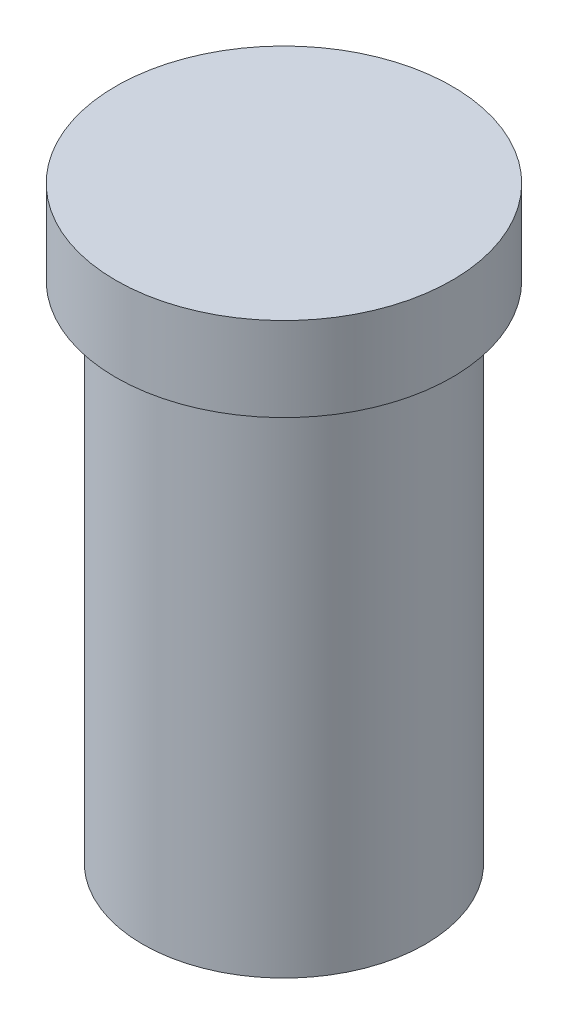
ISO-10303-21;
HEADER;
FILE_DESCRIPTION(('STEP AP214'),'2;1');
FILE_NAME('part.step','',(''),(''),'','','');
FILE_SCHEMA(('AUTOMOTIVE_DESIGN { 1 0 10303 214 1 1 1 1 }'));
ENDSEC;
DATA;
#1=APPLICATION_CONTEXT('core data for automotive mechanical design processes');
#2=APPLICATION_PROTOCOL_DEFINITION('international standard','automotive_design',2000,#1);
#3=PRODUCT_CONTEXT('',#1,'mechanical');
#4=PRODUCT('Part','Part','',(#3));
#5=PRODUCT_RELATED_PRODUCT_CATEGORY('part','',(#4));
#6=PRODUCT_DEFINITION_FORMATION('','',#4);
#7=PRODUCT_DEFINITION_CONTEXT('part definition',#1,'design');
#8=PRODUCT_DEFINITION('design','',#6,#7);
#9=PRODUCT_DEFINITION_SHAPE('','',#8);
#10=(LENGTH_UNIT() NAMED_UNIT(*) SI_UNIT(.MILLI.,.METRE.));
#11=(NAMED_UNIT(*) PLANE_ANGLE_UNIT() SI_UNIT($,.RADIAN.));
#12=(NAMED_UNIT(*) SI_UNIT($,.STERADIAN.) SOLID_ANGLE_UNIT());
#13=UNCERTAINTY_MEASURE_WITH_UNIT(LENGTH_MEASURE(1.E-05),#10,'distance_accuracy_value','');
#14=(GEOMETRIC_REPRESENTATION_CONTEXT(3) GLOBAL_UNCERTAINTY_ASSIGNED_CONTEXT((#13)) GLOBAL_UNIT_ASSIGNED_CONTEXT((#10,
#11,#12)) REPRESENTATION_CONTEXT('',''));
#15=CARTESIAN_POINT('',(0.,0.,0.));
#16=DIRECTION('',(0.,0.,1.));
#17=DIRECTION('',(1.,0.,0.));
#18=AXIS2_PLACEMENT_3D('',#15,#16,#17);
#19=CARTESIAN_POINT('',(-3.175,-18.415,0.));
#20=DIRECTION('',(0.,-1.,0.));
#21=DIRECTION('',(0.,0.,-1.));
#22=AXIS2_PLACEMENT_3D('',#19,#20,#21);
#23=PLANE('',#22);
#24=CARTESIAN_POINT('',(0.,-18.415,0.));
#25=DIRECTION('',(0.,1.,0.));
#26=DIRECTION('',(0.,0.,1.));
#27=AXIS2_PLACEMENT_3D('',#24,#25,#26);
#28=CIRCLE('',#27,3.175);
#29=CARTESIAN_POINT('',(0.,-18.415,3.175));
#30=VERTEX_POINT('',#29);
#31=EDGE_CURVE('E10',#30,#30,#28,.T.);
#32=ORIENTED_EDGE('',*,*,#31,.F.);
#33=EDGE_LOOP('',(#32));
#34=FACE_BOUND('',#33,.T.);
#35=ADVANCED_FACE('F34',(#34),#23,.T.);
#36=CARTESIAN_POINT('',(0.,0.,0.));
#37=DIRECTION('',(0.,1.,0.));
#38=DIRECTION('',(0.,0.,1.));
#39=AXIS2_PLACEMENT_3D('',#36,#37,#38);
#40=CYLINDRICAL_SURFACE('',#39,3.175);
#41=ORIENTED_EDGE('',*,*,#31,.T.);
#42=EDGE_LOOP('',(#41));
#43=FACE_BOUND('',#42,.T.);
#44=CARTESIAN_POINT('',(0.,-22.225,0.));
#45=DIRECTION('',(0.,1.,0.));
#46=DIRECTION('',(0.,0.,1.));
#47=AXIS2_PLACEMENT_3D('',#44,#45,#46);
#48=CIRCLE('',#47,3.175);
#49=CARTESIAN_POINT('',(0.,-22.225,3.175));
#50=VERTEX_POINT('',#49);
#51=EDGE_CURVE('E40',#50,#50,#48,.T.);
#52=ORIENTED_EDGE('',*,*,#51,.F.);
#53=EDGE_LOOP('',(#52));
#54=FACE_BOUND('',#53,.T.);
#55=ADVANCED_FACE('F76',(#43,#54),#40,.F.);
#56=CARTESIAN_POINT('',(-3.175,-22.225,0.));
#57=DIRECTION('',(0.,-1.,0.));
#58=DIRECTION('',(0.,0.,-1.));
#59=AXIS2_PLACEMENT_3D('',#56,#57,#58);
#60=PLANE('',#59);
#61=ORIENTED_EDGE('',*,*,#51,.T.);
#62=EDGE_LOOP('',(#61));
#63=FACE_BOUND('',#62,.T.);
#64=CARTESIAN_POINT('',(0.,-22.225,0.));
#65=DIRECTION('',(0.,1.,0.));
#66=DIRECTION('',(0.,0.,1.));
#67=AXIS2_PLACEMENT_3D('',#64,#65,#66);
#68=CIRCLE('',#67,5.334);
#69=CARTESIAN_POINT('',(0.,-22.225,5.334));
#70=VERTEX_POINT('',#69);
#71=EDGE_CURVE('E44',#70,#70,#68,.T.);
#72=ORIENTED_EDGE('',*,*,#71,.F.);
#73=EDGE_LOOP('',(#72));
#74=FACE_BOUND('',#73,.T.);
#75=ADVANCED_FACE('F81',(#63,#74),#60,.T.);
#76=CARTESIAN_POINT('',(0.,0.,0.));
#77=DIRECTION('',(0.,1.,0.));
#78=DIRECTION('',(0.,0.,1.));
#79=AXIS2_PLACEMENT_3D('',#76,#77,#78);
#80=CYLINDRICAL_SURFACE('',#79,5.334);
#81=ORIENTED_EDGE('',*,*,#71,.T.);
#82=EDGE_LOOP('',(#81));
#83=FACE_BOUND('',#82,.T.);
#84=CARTESIAN_POINT('',(0.,-3.175,0.));
#85=DIRECTION('',(0.,1.,0.));
#86=DIRECTION('',(0.,0.,1.));
#87=AXIS2_PLACEMENT_3D('',#84,#85,#86);
#88=CIRCLE('',#87,5.334);
#89=CARTESIAN_POINT('',(0.,-3.175,5.334));
#90=VERTEX_POINT('',#89);
#91=EDGE_CURVE('E48',#90,#90,#88,.T.);
#92=ORIENTED_EDGE('',*,*,#91,.F.);
#93=EDGE_LOOP('',(#92));
#94=FACE_BOUND('',#93,.T.);
#95=ADVANCED_FACE('F72',(#83,#94),#80,.T.);
#96=CARTESIAN_POINT('',(-5.334,-3.175,0.));
#97=DIRECTION('',(0.,-1.,0.));
#98=DIRECTION('',(0.,0.,-1.));
#99=AXIS2_PLACEMENT_3D('',#96,#97,#98);
#100=PLANE('',#99);
#101=ORIENTED_EDGE('',*,*,#91,.T.);
#102=EDGE_LOOP('',(#101));
#103=FACE_BOUND('',#102,.T.);
#104=CARTESIAN_POINT('',(0.,-3.175,0.));
#105=DIRECTION('',(0.,1.,0.));
#106=DIRECTION('',(0.,0.,1.));
#107=AXIS2_PLACEMENT_3D('',#104,#105,#106);
#108=CIRCLE('',#107,6.35);
#109=CARTESIAN_POINT('',(0.,-3.175,6.35));
#110=VERTEX_POINT('',#109);
#111=EDGE_CURVE('E53',#110,#110,#108,.T.);
#112=ORIENTED_EDGE('',*,*,#111,.F.);
#113=EDGE_LOOP('',(#112));
#114=FACE_BOUND('',#113,.T.);
#115=ADVANCED_FACE('F64',(#103,#114),#100,.T.);
#116=CARTESIAN_POINT('',(0.,0.,0.));
#117=DIRECTION('',(0.,1.,0.));
#118=DIRECTION('',(0.,0.,1.));
#119=AXIS2_PLACEMENT_3D('',#116,#117,#118);
#120=CYLINDRICAL_SURFACE('',#119,6.35);
#121=ORIENTED_EDGE('',*,*,#111,.T.);
#122=EDGE_LOOP('',(#121));
#123=FACE_BOUND('',#122,.T.);
#124=CARTESIAN_POINT('',(0.,0.,0.));
#125=DIRECTION('',(0.,1.,0.));
#126=DIRECTION('',(0.,0.,1.));
#127=AXIS2_PLACEMENT_3D('',#124,#125,#126);
#128=CIRCLE('',#127,6.35);
#129=CARTESIAN_POINT('',(0.,0.,6.35));
#130=VERTEX_POINT('',#129);
#131=EDGE_CURVE('E56',#130,#130,#128,.T.);
#132=ORIENTED_EDGE('',*,*,#131,.F.);
#133=EDGE_LOOP('',(#132));
#134=FACE_BOUND('',#133,.T.);
#135=ADVANCED_FACE('F62',(#123,#134),#120,.T.);
#136=CARTESIAN_POINT('',(-6.35,0.,0.));
#137=DIRECTION('',(0.,1.,0.));
#138=DIRECTION('',(0.,0.,1.));
#139=AXIS2_PLACEMENT_3D('',#136,#137,#138);
#140=PLANE('',#139);
#141=ORIENTED_EDGE('',*,*,#131,.T.);
#142=EDGE_LOOP('',(#141));
#143=FACE_BOUND('',#142,.T.);
#144=ADVANCED_FACE('F60',(#143),#140,.T.);
#145=CLOSED_SHELL('',(#35,#55,#75,#95,#115,#135,#144));
#146=MANIFOLD_SOLID_BREP('B2',#145);
#147=ADVANCED_BREP_SHAPE_REPRESENTATION('',(#18,#146),#14);
#148=SHAPE_DEFINITION_REPRESENTATION(#9,#147);
ENDSEC;
END-ISO-10303-21;
